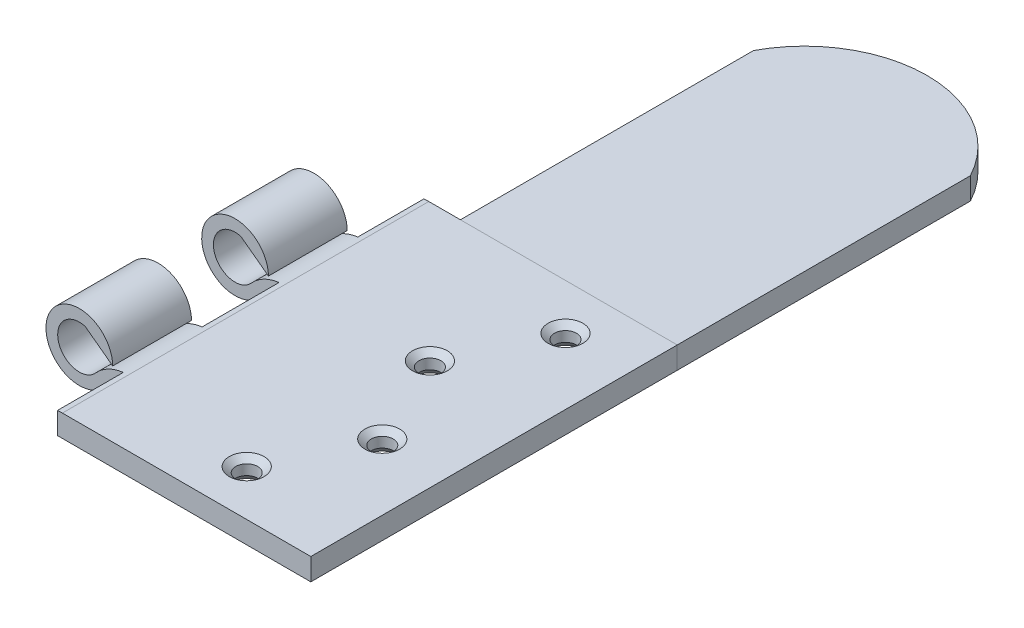
ISO-10303-21;
HEADER;
FILE_DESCRIPTION(('STEP AP214'),'2;1');
FILE_NAME('part.step','',(''),(''),'','','');
FILE_SCHEMA(('AUTOMOTIVE_DESIGN { 1 0 10303 214 1 1 1 1 }'));
ENDSEC;
DATA;
#1=APPLICATION_CONTEXT('core data for automotive mechanical design processes');
#2=APPLICATION_PROTOCOL_DEFINITION('international standard','automotive_design',2000,#1);
#3=PRODUCT_CONTEXT('',#1,'mechanical');
#4=PRODUCT('Part','Part','',(#3));
#5=PRODUCT_RELATED_PRODUCT_CATEGORY('part','',(#4));
#6=PRODUCT_DEFINITION_FORMATION('','',#4);
#7=PRODUCT_DEFINITION_CONTEXT('part definition',#1,'design');
#8=PRODUCT_DEFINITION('design','',#6,#7);
#9=PRODUCT_DEFINITION_SHAPE('','',#8);
#10=(LENGTH_UNIT() NAMED_UNIT(*) SI_UNIT(.MILLI.,.METRE.));
#11=(NAMED_UNIT(*) PLANE_ANGLE_UNIT() SI_UNIT($,.RADIAN.));
#12=(NAMED_UNIT(*) SI_UNIT($,.STERADIAN.) SOLID_ANGLE_UNIT());
#13=UNCERTAINTY_MEASURE_WITH_UNIT(LENGTH_MEASURE(1.E-05),#10,'distance_accuracy_value','');
#14=(GEOMETRIC_REPRESENTATION_CONTEXT(3) GLOBAL_UNCERTAINTY_ASSIGNED_CONTEXT((#13)) GLOBAL_UNIT_ASSIGNED_CONTEXT((#10,
#11,#12)) REPRESENTATION_CONTEXT('',''));
#15=CARTESIAN_POINT('',(0.,0.,0.));
#16=DIRECTION('',(0.,0.,1.));
#17=DIRECTION('',(1.,0.,0.));
#18=AXIS2_PLACEMENT_3D('',#15,#16,#17);
#19=CARTESIAN_POINT('',(40.5871280636835,0.044999999999999,-25.));
#20=DIRECTION('',(1.,0.,0.));
#21=DIRECTION('',(0.,0.,-1.));
#22=AXIS2_PLACEMENT_3D('',#19,#20,#21);
#23=PLANE('',#22);
#24=DIRECTION('',(0.,0.,1.));
#25=VECTOR('',#24,1.);
#26=CARTESIAN_POINT('',(40.5871280636835,-2.955,-25.));
#27=LINE('',#26,#25);
#28=CARTESIAN_POINT('',(40.5871280636835,-2.955,-65.));
#29=VERTEX_POINT('',#28);
#30=CARTESIAN_POINT('',(40.5871280636835,-2.955,-25.));
#31=VERTEX_POINT('',#30);
#32=EDGE_CURVE('E112',#29,#31,#27,.T.);
#33=ORIENTED_EDGE('',*,*,#32,.F.);
#34=DIRECTION('',(0.,-1.,0.));
#35=VECTOR('',#34,1.);
#36=CARTESIAN_POINT('',(40.5871280636835,0.044999999999999,-65.));
#37=LINE('',#36,#35);
#38=CARTESIAN_POINT('',(40.5871280636835,0.044999999999999,-65.));
#39=VERTEX_POINT('',#38);
#40=EDGE_CURVE('E12',#39,#29,#37,.T.);
#41=ORIENTED_EDGE('',*,*,#40,.F.);
#42=DIRECTION('',(0.,0.,1.));
#43=VECTOR('',#42,1.);
#44=CARTESIAN_POINT('',(40.5871280636835,0.044999999999999,-25.));
#45=LINE('',#44,#43);
#46=CARTESIAN_POINT('',(40.5871280636835,0.044999999999999,-25.));
#47=VERTEX_POINT('',#46);
#48=EDGE_CURVE('E106',#39,#47,#45,.T.);
#49=ORIENTED_EDGE('',*,*,#48,.T.);
#50=DIRECTION('',(0.,-1.,0.));
#51=VECTOR('',#50,1.);
#52=CARTESIAN_POINT('',(40.5871280636835,0.044999999999999,-25.));
#53=LINE('',#52,#51);
#54=EDGE_CURVE('E51',#47,#31,#53,.T.);
#55=ORIENTED_EDGE('',*,*,#54,.T.);
#56=EDGE_LOOP('',(#33,#41,#49,#55));
#57=FACE_BOUND('',#56,.T.);
#58=ADVANCED_FACE('F48',(#57),#23,.T.);
#59=CARTESIAN_POINT('',(25.7935640318418,0.044999999999999,-57.144240123591));
#60=DIRECTION('',(0.,-1.,0.));
#61=DIRECTION('',(0.,0.,-1.));
#62=AXIS2_PLACEMENT_3D('',#59,#60,#61);
#63=CYLINDRICAL_SURFACE('',#62,16.75);
#64=CARTESIAN_POINT('',(25.7935640318418,-2.955,-57.144240123591));
#65=DIRECTION('',(0.,-1.,0.));
#66=DIRECTION('',(0.,0.,-1.));
#67=AXIS2_PLACEMENT_3D('',#64,#65,#66);
#68=CIRCLE('',#67,16.75);
#69=CARTESIAN_POINT('',(11.,-2.955,-65.));
#70=VERTEX_POINT('',#69);
#71=EDGE_CURVE('E108',#70,#29,#68,.T.);
#72=ORIENTED_EDGE('',*,*,#71,.F.);
#73=DIRECTION('',(0.,-1.,0.));
#74=VECTOR('',#73,1.);
#75=CARTESIAN_POINT('',(11.,0.044999999999999,-65.));
#76=LINE('',#75,#74);
#77=CARTESIAN_POINT('',(11.,0.044999999999999,-65.));
#78=VERTEX_POINT('',#77);
#79=EDGE_CURVE('E57',#78,#70,#76,.T.);
#80=ORIENTED_EDGE('',*,*,#79,.F.);
#81=CARTESIAN_POINT('',(25.7935640318418,0.044999999999999,-57.144240123591));
#82=DIRECTION('',(0.,-1.,0.));
#83=DIRECTION('',(0.,0.,-1.));
#84=AXIS2_PLACEMENT_3D('',#81,#82,#83);
#85=CIRCLE('',#84,16.75);
#86=EDGE_CURVE('E103',#78,#39,#85,.T.);
#87=ORIENTED_EDGE('',*,*,#86,.T.);
#88=ORIENTED_EDGE('',*,*,#40,.T.);
#89=EDGE_LOOP('',(#72,#80,#87,#88));
#90=FACE_BOUND('',#89,.T.);
#91=ADVANCED_FACE('F122',(#90),#63,.T.);
#92=CARTESIAN_POINT('',(11.,0.044999999999999,-25.));
#93=DIRECTION('',(-1.,0.,0.));
#94=DIRECTION('',(0.,0.,1.));
#95=AXIS2_PLACEMENT_3D('',#92,#93,#94);
#96=PLANE('',#95);
#97=DIRECTION('',(0.,0.,-1.));
#98=VECTOR('',#97,1.);
#99=CARTESIAN_POINT('',(11.,-2.955,-25.));
#100=LINE('',#99,#98);
#101=CARTESIAN_POINT('',(11.,-2.955,-25.));
#102=VERTEX_POINT('',#101);
#103=EDGE_CURVE('E98',#102,#70,#100,.T.);
#104=ORIENTED_EDGE('',*,*,#103,.F.);
#105=DIRECTION('',(0.,-1.,0.));
#106=VECTOR('',#105,1.);
#107=CARTESIAN_POINT('',(11.,0.044999999999999,-25.));
#108=LINE('',#107,#106);
#109=CARTESIAN_POINT('',(11.,0.044999999999999,-25.));
#110=VERTEX_POINT('',#109);
#111=EDGE_CURVE('E93',#110,#102,#108,.T.);
#112=ORIENTED_EDGE('',*,*,#111,.F.);
#113=DIRECTION('',(0.,0.,-1.));
#114=VECTOR('',#113,1.);
#115=CARTESIAN_POINT('',(11.,0.044999999999999,-25.));
#116=LINE('',#115,#114);
#117=EDGE_CURVE('E96',#110,#78,#116,.T.);
#118=ORIENTED_EDGE('',*,*,#117,.T.);
#119=ORIENTED_EDGE('',*,*,#79,.T.);
#120=EDGE_LOOP('',(#104,#112,#118,#119));
#121=FACE_BOUND('',#120,.T.);
#122=ADVANCED_FACE('F95',(#121),#96,.T.);
#123=CARTESIAN_POINT('',(40.5871280636835,0.044999999999999,-25.));
#124=DIRECTION('',(0.,0.,1.));
#125=DIRECTION('',(1.,0.,0.));
#126=AXIS2_PLACEMENT_3D('',#123,#124,#125);
#127=PLANE('',#126);
#128=DIRECTION('',(-1.,0.,0.));
#129=VECTOR('',#128,1.);
#130=CARTESIAN_POINT('',(40.5871280636835,-2.955,-25.));
#131=LINE('',#130,#129);
#132=EDGE_CURVE('E115',#31,#102,#131,.T.);
#133=ORIENTED_EDGE('',*,*,#132,.F.);
#134=ORIENTED_EDGE('',*,*,#54,.F.);
#135=DIRECTION('',(-1.,0.,0.));
#136=VECTOR('',#135,1.);
#137=CARTESIAN_POINT('',(40.5871280636835,0.044999999999999,-25.));
#138=LINE('',#137,#136);
#139=EDGE_CURVE('E102',#47,#110,#138,.T.);
#140=ORIENTED_EDGE('',*,*,#139,.T.);
#141=ORIENTED_EDGE('',*,*,#111,.T.);
#142=EDGE_LOOP('',(#133,#134,#140,#141));
#143=FACE_BOUND('',#142,.T.);
#144=ADVANCED_FACE('F105',(#143),#127,.T.);
#145=CARTESIAN_POINT('',(25.7935640318418,0.044999999999999,-57.144240123591));
#146=DIRECTION('',(0.,-1.,0.));
#147=DIRECTION('',(0.,0.,-1.));
#148=AXIS2_PLACEMENT_3D('',#145,#146,#147);
#149=PLANE('',#148);
#150=ORIENTED_EDGE('',*,*,#48,.F.);
#151=ORIENTED_EDGE('',*,*,#86,.F.);
#152=ORIENTED_EDGE('',*,*,#117,.F.);
#153=ORIENTED_EDGE('',*,*,#139,.F.);
#154=EDGE_LOOP('',(#150,#151,#152,#153));
#155=FACE_BOUND('',#154,.T.);
#156=ADVANCED_FACE('F101',(#155),#149,.F.);
#157=CARTESIAN_POINT('',(25.7935640318418,-2.955,-57.144240123591));
#158=DIRECTION('',(0.,-1.,0.));
#159=DIRECTION('',(0.,0.,-1.));
#160=AXIS2_PLACEMENT_3D('',#157,#158,#159);
#161=PLANE('',#160);
#162=ORIENTED_EDGE('',*,*,#32,.T.);
#163=ORIENTED_EDGE('',*,*,#132,.T.);
#164=ORIENTED_EDGE('',*,*,#103,.T.);
#165=ORIENTED_EDGE('',*,*,#71,.T.);
#166=EDGE_LOOP('',(#162,#163,#164,#165));
#167=FACE_BOUND('',#166,.T.);
#168=ADVANCED_FACE('F121',(#167),#161,.T.);
#169=CLOSED_SHELL('',(#58,#91,#122,#144,#156,#168));
#170=MANIFOLD_SOLID_BREP('B2',#169);
#171=CARTESIAN_POINT('',(6.68804904288239,-5.955,25.));
#172=DIRECTION('',(0.,0.,-1.));
#173=DIRECTION('',(-1.,0.,0.));
#174=AXIS2_PLACEMENT_3D('',#171,#172,#173);
#175=CYLINDRICAL_SURFACE('',#174,6.);
#176=DIRECTION('',(0.,0.,-1.));
#177=VECTOR('',#176,1.);
#178=CARTESIAN_POINT('',(6.,0.00541848485394701,25.));
#179=LINE('',#178,#177);
#180=CARTESIAN_POINT('',(6.,0.00541848485394701,25.));
#181=VERTEX_POINT('',#180);
#182=CARTESIAN_POINT('',(6.,0.00541848485394701,16.));
#183=VERTEX_POINT('',#182);
#184=EDGE_CURVE('E331',#181,#183,#179,.T.);
#185=ORIENTED_EDGE('',*,*,#184,.F.);
#186=CARTESIAN_POINT('',(6.68804904288239,-5.955,25.));
#187=DIRECTION('',(0.,0.,1.));
#188=DIRECTION('',(1.,0.,0.));
#189=AXIS2_PLACEMENT_3D('',#186,#187,#188);
#190=CIRCLE('',#189,6.);
#191=CARTESIAN_POINT('',(6.68804904288239,0.044999999999999,25.));
#192=VERTEX_POINT('',#191);
#193=EDGE_CURVE('E375',#192,#181,#190,.T.);
#194=ORIENTED_EDGE('',*,*,#193,.F.);
#195=DIRECTION('',(0.,0.,-1.));
#196=VECTOR('',#195,1.);
#197=CARTESIAN_POINT('',(6.68804904288239,0.044999999999999,25.));
#198=LINE('',#197,#196);
#199=CARTESIAN_POINT('',(6.68804904288239,0.044999999999999,-25.));
#200=VERTEX_POINT('',#199);
#201=EDGE_CURVE('E385',#192,#200,#198,.T.);
#202=ORIENTED_EDGE('',*,*,#201,.T.);
#203=CARTESIAN_POINT('',(6.68804904288239,-5.955,-25.));
#204=DIRECTION('',(0.,0.,1.));
#205=DIRECTION('',(1.,0.,0.));
#206=AXIS2_PLACEMENT_3D('',#203,#204,#205);
#207=CIRCLE('',#206,6.);
#208=CARTESIAN_POINT('',(6.00000000000001,0.00541848485394701,-25.));
#209=VERTEX_POINT('',#208);
#210=EDGE_CURVE('E329',#200,#209,#207,.T.);
#211=ORIENTED_EDGE('',*,*,#210,.T.);
#212=DIRECTION('',(0.,0.,-1.));
#213=VECTOR('',#212,1.);
#214=CARTESIAN_POINT('',(6.00000000000001,0.00541848485394788,25.));
#215=LINE('',#214,#213);
#216=CARTESIAN_POINT('',(6.00000000000001,0.00541848485394788,-16.));
#217=VERTEX_POINT('',#216);
#218=EDGE_CURVE('E318',#217,#209,#215,.T.);
#219=ORIENTED_EDGE('',*,*,#218,.F.);
#220=CARTESIAN_POINT('',(6.68804904288239,-5.955,-16.));
#221=DIRECTION('',(0.,0.,-1.));
#222=DIRECTION('',(-1.,0.,0.));
#223=AXIS2_PLACEMENT_3D('',#220,#221,#222);
#224=CIRCLE('',#223,6.);
#225=CARTESIAN_POINT('',(2.20694415652903,-1.96505025125629,-16.));
#226=VERTEX_POINT('',#225);
#227=EDGE_CURVE('E303',#226,#217,#224,.T.);
#228=ORIENTED_EDGE('',*,*,#227,.F.);
#229=DIRECTION('',(0.,0.,-1.));
#230=VECTOR('',#229,1.);
#231=CARTESIAN_POINT('',(2.20694415652903,-1.96505025125629,25.));
#232=LINE('',#231,#230);
#233=CARTESIAN_POINT('',(2.20694415652903,-1.96505025125629,-5.25));
#234=VERTEX_POINT('',#233);
#235=EDGE_CURVE('E415',#234,#226,#232,.T.);
#236=ORIENTED_EDGE('',*,*,#235,.F.);
#237=CARTESIAN_POINT('',(6.68804904288239,-5.955,-5.25));
#238=DIRECTION('',(0.,0.,1.));
#239=DIRECTION('',(1.,0.,0.));
#240=AXIS2_PLACEMENT_3D('',#237,#238,#239);
#241=CIRCLE('',#240,6.);
#242=CARTESIAN_POINT('',(6.,0.00541848485394701,-5.25));
#243=VERTEX_POINT('',#242);
#244=EDGE_CURVE('E345',#243,#234,#241,.T.);
#245=ORIENTED_EDGE('',*,*,#244,.F.);
#246=DIRECTION('',(0.,0.,-1.));
#247=VECTOR('',#246,1.);
#248=CARTESIAN_POINT('',(6.,0.00541848485394701,25.));
#249=LINE('',#248,#247);
#250=CARTESIAN_POINT('',(6.,0.00541848485394701,5.25));
#251=VERTEX_POINT('',#250);
#252=EDGE_CURVE('E347',#251,#243,#249,.T.);
#253=ORIENTED_EDGE('',*,*,#252,.F.);
#254=CARTESIAN_POINT('',(6.68804904288239,-5.955,5.25));
#255=DIRECTION('',(0.,0.,-1.));
#256=DIRECTION('',(-1.,0.,0.));
#257=AXIS2_PLACEMENT_3D('',#254,#255,#256);
#258=CIRCLE('',#257,6.);
#259=CARTESIAN_POINT('',(2.20694415652903,-1.96505025125629,5.25));
#260=VERTEX_POINT('',#259);
#261=EDGE_CURVE('E357',#260,#251,#258,.T.);
#262=ORIENTED_EDGE('',*,*,#261,.F.);
#263=CARTESIAN_POINT('',(2.20694415652903,-1.96505025125629,16.));
#264=VERTEX_POINT('',#263);
#265=EDGE_CURVE('E417',#264,#260,#232,.T.);
#266=ORIENTED_EDGE('',*,*,#265,.F.);
#267=CARTESIAN_POINT('',(6.68804904288239,-5.955,16.));
#268=DIRECTION('',(0.,0.,1.));
#269=DIRECTION('',(1.,0.,0.));
#270=AXIS2_PLACEMENT_3D('',#267,#268,#269);
#271=CIRCLE('',#270,6.);
#272=EDGE_CURVE('E373',#183,#264,#271,.T.);
#273=ORIENTED_EDGE('',*,*,#272,.F.);
#274=EDGE_LOOP('',(#185,#194,#202,#211,#219,#228,#236,#245,#253,#262,#266,#273));
#275=FACE_BOUND('',#274,.T.);
#276=ADVANCED_FACE('F171',(#275),#175,.T.);
#277=CARTESIAN_POINT('',(0.,0.,25.));
#278=DIRECTION('',(0.,0.,-1.));
#279=DIRECTION('',(-1.,0.,0.));
#280=AXIS2_PLACEMENT_3D('',#277,#278,#279);
#281=CYLINDRICAL_SURFACE('',#280,2.95500000000001);
#282=CARTESIAN_POINT('',(0.,0.,16.));
#283=DIRECTION('',(0.,0.,1.));
#284=DIRECTION('',(1.,0.,0.));
#285=AXIS2_PLACEMENT_3D('',#282,#283,#284);
#286=CIRCLE('',#285,2.95500000000001);
#287=CARTESIAN_POINT('',(0.789396386604457,2.84760923316664,16.));
#288=VERTEX_POINT('',#287);
#289=EDGE_CURVE('E371',#264,#288,#286,.F.);
#290=ORIENTED_EDGE('',*,*,#289,.F.);
#291=ORIENTED_EDGE('',*,*,#265,.T.);
#292=CARTESIAN_POINT('',(0.,0.,5.25));
#293=DIRECTION('',(0.,0.,-1.));
#294=DIRECTION('',(-1.,0.,0.));
#295=AXIS2_PLACEMENT_3D('',#292,#293,#294);
#296=CIRCLE('',#295,2.95500000000001);
#297=CARTESIAN_POINT('',(0.789396386604457,2.84760923316664,5.25000000000001));
#298=VERTEX_POINT('',#297);
#299=EDGE_CURVE('E355',#298,#260,#296,.F.);
#300=ORIENTED_EDGE('',*,*,#299,.F.);
#301=DIRECTION('',(0.,0.,-1.));
#302=VECTOR('',#301,1.);
#303=CARTESIAN_POINT('',(0.789396386604457,2.84760923316664,25.));
#304=LINE('',#303,#302);
#305=EDGE_CURVE('E414',#288,#298,#304,.T.);
#306=ORIENTED_EDGE('',*,*,#305,.F.);
#307=EDGE_LOOP('',(#290,#291,#300,#306));
#308=FACE_BOUND('',#307,.T.);
#309=ADVANCED_FACE('F504',(#308),#281,.F.);
#310=CARTESIAN_POINT('',(0.,0.,-16.));
#311=DIRECTION('',(0.,0.,-1.));
#312=DIRECTION('',(-1.,0.,0.));
#313=AXIS2_PLACEMENT_3D('',#310,#311,#312);
#314=CIRCLE('',#313,2.95500000000001);
#315=CARTESIAN_POINT('',(0.789396386604457,2.84760923316664,-16.));
#316=VERTEX_POINT('',#315);
#317=EDGE_CURVE('E309',#316,#226,#314,.F.);
#318=ORIENTED_EDGE('',*,*,#317,.F.);
#319=CARTESIAN_POINT('',(0.789396386604457,2.84760923316664,-5.25));
#320=VERTEX_POINT('',#319);
#321=EDGE_CURVE('E411',#320,#316,#304,.T.);
#322=ORIENTED_EDGE('',*,*,#321,.F.);
#323=CARTESIAN_POINT('',(0.,0.,-5.25));
#324=DIRECTION('',(0.,0.,1.));
#325=DIRECTION('',(1.,0.,0.));
#326=AXIS2_PLACEMENT_3D('',#323,#324,#325);
#327=CIRCLE('',#326,2.95500000000001);
#328=EDGE_CURVE('E343',#234,#320,#327,.F.);
#329=ORIENTED_EDGE('',*,*,#328,.F.);
#330=ORIENTED_EDGE('',*,*,#235,.T.);
#331=EDGE_LOOP('',(#318,#322,#329,#330));
#332=FACE_BOUND('',#331,.T.);
#333=ADVANCED_FACE('F509',(#332),#281,.F.);
#334=CARTESIAN_POINT('',(4.55477771137078,0.044999999999999,25.));
#335=DIRECTION('',(0.597074522144533,0.802185773375393,0.));
#336=DIRECTION('',(-0.802185773375393,0.597074522144533,0.));
#337=AXIS2_PLACEMENT_3D('',#334,#335,#336);
#338=PLANE('',#337);
#339=DIRECTION('',(0.802185773375393,-0.597074522144533,0.));
#340=VECTOR('',#339,1.);
#341=CARTESIAN_POINT('',(4.55477771137078,0.044999999999999,16.));
#342=LINE('',#341,#340);
#343=CARTESIAN_POINT('',(4.55477771137078,0.044999999999999,16.));
#344=VERTEX_POINT('',#343);
#345=EDGE_CURVE('E369',#288,#344,#342,.T.);
#346=ORIENTED_EDGE('',*,*,#345,.F.);
#347=ORIENTED_EDGE('',*,*,#305,.T.);
#348=DIRECTION('',(-0.802185773375393,0.597074522144533,0.));
#349=VECTOR('',#348,1.);
#350=CARTESIAN_POINT('',(4.55477771137077,0.0450000000000011,5.25));
#351=LINE('',#350,#349);
#352=CARTESIAN_POINT('',(4.55477771137078,0.044999999999999,5.25));
#353=VERTEX_POINT('',#352);
#354=EDGE_CURVE('E353',#353,#298,#351,.T.);
#355=ORIENTED_EDGE('',*,*,#354,.F.);
#356=DIRECTION('',(0.,0.,-1.));
#357=VECTOR('',#356,1.);
#358=CARTESIAN_POINT('',(4.55477771137078,0.044999999999999,25.));
#359=LINE('',#358,#357);
#360=EDGE_CURVE('E410',#344,#353,#359,.T.);
#361=ORIENTED_EDGE('',*,*,#360,.F.);
#362=EDGE_LOOP('',(#346,#347,#355,#361));
#363=FACE_BOUND('',#362,.T.);
#364=ADVANCED_FACE('F609',(#363),#338,.F.);
#365=DIRECTION('',(-0.802185773375393,0.597074522144533,0.));
#366=VECTOR('',#365,1.);
#367=CARTESIAN_POINT('',(4.55477771137078,0.044999999999999,-16.));
#368=LINE('',#367,#366);
#369=CARTESIAN_POINT('',(4.55477771137078,0.044999999999999,-16.));
#370=VERTEX_POINT('',#369);
#371=EDGE_CURVE('E363',#370,#316,#368,.T.);
#372=ORIENTED_EDGE('',*,*,#371,.F.);
#373=CARTESIAN_POINT('',(4.55477771137078,0.044999999999999,-5.25));
#374=VERTEX_POINT('',#373);
#375=EDGE_CURVE('E407',#374,#370,#359,.T.);
#376=ORIENTED_EDGE('',*,*,#375,.F.);
#377=DIRECTION('',(0.802185773375393,-0.597074522144533,0.));
#378=VECTOR('',#377,1.);
#379=CARTESIAN_POINT('',(4.55477771137077,0.0450000000000032,-5.25));
#380=LINE('',#379,#378);
#381=EDGE_CURVE('E341',#320,#374,#380,.T.);
#382=ORIENTED_EDGE('',*,*,#381,.F.);
#383=ORIENTED_EDGE('',*,*,#321,.T.);
#384=EDGE_LOOP('',(#372,#376,#382,#383));
#385=FACE_BOUND('',#384,.T.);
#386=ADVANCED_FACE('F573',(#385),#338,.F.);
#387=CARTESIAN_POINT('',(0.,0.,25.));
#388=DIRECTION('',(0.,0.,-1.));
#389=DIRECTION('',(-1.,0.,0.));
#390=AXIS2_PLACEMENT_3D('',#387,#388,#389);
#391=CYLINDRICAL_SURFACE('',#390,4.555);
#392=CARTESIAN_POINT('',(0.,0.,16.));
#393=DIRECTION('',(0.,0.,1.));
#394=DIRECTION('',(1.,0.,0.));
#395=AXIS2_PLACEMENT_3D('',#392,#393,#394);
#396=CIRCLE('',#395,4.555);
#397=CARTESIAN_POINT('',(2.41111969020166,-3.86452155376599,16.));
#398=VERTEX_POINT('',#397);
#399=EDGE_CURVE('E367',#344,#398,#396,.T.);
#400=ORIENTED_EDGE('',*,*,#399,.F.);
#401=ORIENTED_EDGE('',*,*,#360,.T.);
#402=CARTESIAN_POINT('',(0.,0.,5.25));
#403=DIRECTION('',(0.,0.,-1.));
#404=DIRECTION('',(-1.,0.,0.));
#405=AXIS2_PLACEMENT_3D('',#402,#403,#404);
#406=CIRCLE('',#405,4.555);
#407=CARTESIAN_POINT('',(2.41111969020166,-3.86452155376599,5.25000000000001));
#408=VERTEX_POINT('',#407);
#409=EDGE_CURVE('E351',#408,#353,#406,.T.);
#410=ORIENTED_EDGE('',*,*,#409,.F.);
#411=DIRECTION('',(0.,0.,-1.));
#412=VECTOR('',#411,1.);
#413=CARTESIAN_POINT('',(2.41111969020166,-3.86452155376599,25.));
#414=LINE('',#413,#412);
#415=EDGE_CURVE('E406',#398,#408,#414,.T.);
#416=ORIENTED_EDGE('',*,*,#415,.F.);
#417=EDGE_LOOP('',(#400,#401,#410,#416));
#418=FACE_BOUND('',#417,.T.);
#419=ADVANCED_FACE('F616',(#418),#391,.T.);
#420=CARTESIAN_POINT('',(0.,0.,-16.));
#421=DIRECTION('',(0.,0.,-1.));
#422=DIRECTION('',(-1.,0.,0.));
#423=AXIS2_PLACEMENT_3D('',#420,#421,#422);
#424=CIRCLE('',#423,4.555);
#425=CARTESIAN_POINT('',(2.41111969020166,-3.86452155376599,-16.));
#426=VERTEX_POINT('',#425);
#427=EDGE_CURVE('E361',#426,#370,#424,.T.);
#428=ORIENTED_EDGE('',*,*,#427,.F.);
#429=CARTESIAN_POINT('',(2.41111969020166,-3.86452155376599,-5.25));
#430=VERTEX_POINT('',#429);
#431=EDGE_CURVE('E403',#430,#426,#414,.T.);
#432=ORIENTED_EDGE('',*,*,#431,.F.);
#433=CARTESIAN_POINT('',(0.,0.,-5.25));
#434=DIRECTION('',(0.,0.,1.));
#435=DIRECTION('',(1.,0.,0.));
#436=AXIS2_PLACEMENT_3D('',#433,#434,#435);
#437=CIRCLE('',#436,4.555);
#438=EDGE_CURVE('E339',#374,#430,#437,.T.);
#439=ORIENTED_EDGE('',*,*,#438,.F.);
#440=ORIENTED_EDGE('',*,*,#375,.T.);
#441=EDGE_LOOP('',(#428,#432,#439,#440));
#442=FACE_BOUND('',#441,.T.);
#443=ADVANCED_FACE('F569',(#442),#391,.T.);
#444=CARTESIAN_POINT('',(5.58712806368353,-8.955,25.));
#445=DIRECTION('',(0.,0.,-1.));
#446=DIRECTION('',(-1.,0.,0.));
#447=AXIS2_PLACEMENT_3D('',#444,#445,#446);
#448=CYLINDRICAL_SURFACE('',#447,6.);
#449=CARTESIAN_POINT('',(5.58712806368353,-8.955,16.));
#450=DIRECTION('',(0.,0.,1.));
#451=DIRECTION('',(1.,0.,0.));
#452=AXIS2_PLACEMENT_3D('',#449,#450,#451);
#453=CIRCLE('',#452,6.);
#454=CARTESIAN_POINT('',(5.58712806368353,-2.955,16.));
#455=VERTEX_POINT('',#454);
#456=EDGE_CURVE('E314',#398,#455,#453,.F.);
#457=ORIENTED_EDGE('',*,*,#456,.F.);
#458=ORIENTED_EDGE('',*,*,#415,.T.);
#459=CARTESIAN_POINT('',(5.58712806368353,-8.955,5.25));
#460=DIRECTION('',(0.,0.,-1.));
#461=DIRECTION('',(-1.,0.,0.));
#462=AXIS2_PLACEMENT_3D('',#459,#460,#461);
#463=CIRCLE('',#462,6.);
#464=CARTESIAN_POINT('',(5.58712806368353,-2.955,5.25));
#465=VERTEX_POINT('',#464);
#466=EDGE_CURVE('E349',#465,#408,#463,.F.);
#467=ORIENTED_EDGE('',*,*,#466,.F.);
#468=DIRECTION('',(0.,0.,-1.));
#469=VECTOR('',#468,1.);
#470=CARTESIAN_POINT('',(5.58712806368353,-2.955,25.));
#471=LINE('',#470,#469);
#472=EDGE_CURVE('E402',#455,#465,#471,.T.);
#473=ORIENTED_EDGE('',*,*,#472,.F.);
#474=EDGE_LOOP('',(#457,#458,#467,#473));
#475=FACE_BOUND('',#474,.T.);
#476=ADVANCED_FACE('F621',(#475),#448,.F.);
#477=CARTESIAN_POINT('',(5.58712806368353,-8.955,-16.));
#478=DIRECTION('',(0.,0.,-1.));
#479=DIRECTION('',(-1.,0.,0.));
#480=AXIS2_PLACEMENT_3D('',#477,#478,#479);
#481=CIRCLE('',#480,6.);
#482=CARTESIAN_POINT('',(5.58712806368353,-2.955,-16.));
#483=VERTEX_POINT('',#482);
#484=EDGE_CURVE('E359',#483,#426,#481,.F.);
#485=ORIENTED_EDGE('',*,*,#484,.F.);
#486=CARTESIAN_POINT('',(5.58712806368353,-2.955,-5.25));
#487=VERTEX_POINT('',#486);
#488=EDGE_CURVE('E399',#487,#483,#471,.T.);
#489=ORIENTED_EDGE('',*,*,#488,.F.);
#490=CARTESIAN_POINT('',(5.58712806368353,-8.955,-5.25));
#491=DIRECTION('',(0.,0.,1.));
#492=DIRECTION('',(1.,0.,0.));
#493=AXIS2_PLACEMENT_3D('',#490,#491,#492);
#494=CIRCLE('',#493,6.);
#495=EDGE_CURVE('E186',#430,#487,#494,.F.);
#496=ORIENTED_EDGE('',*,*,#495,.F.);
#497=ORIENTED_EDGE('',*,*,#431,.T.);
#498=EDGE_LOOP('',(#485,#489,#496,#497));
#499=FACE_BOUND('',#498,.T.);
#500=ADVANCED_FACE('F565',(#499),#448,.F.);
#501=CARTESIAN_POINT('',(5.58712806368353,-2.955,25.));
#502=DIRECTION('',(0.,1.,0.));
#503=DIRECTION('',(0.,0.,1.));
#504=AXIS2_PLACEMENT_3D('',#501,#502,#503);
#505=PLANE('',#504);
#506=CARTESIAN_POINT('',(31.5871280636835,-2.955,-18.75));
#507=DIRECTION('',(0.,1.,0.));
#508=DIRECTION('',(0.,0.,1.));
#509=AXIS2_PLACEMENT_3D('',#506,#507,#508);
#510=CIRCLE('',#509,2.23421217728012);
#511=CARTESIAN_POINT('',(31.5871280636835,-2.955,-16.5157878227199));
#512=VERTEX_POINT('',#511);
#513=EDGE_CURVE('E441',#512,#512,#510,.T.);
#514=ORIENTED_EDGE('',*,*,#513,.T.);
#515=EDGE_LOOP('',(#514));
#516=FACE_BOUND('',#515,.T.);
#517=CARTESIAN_POINT('',(25.5871280636835,-2.955,-6.25));
#518=DIRECTION('',(0.,1.,0.));
#519=DIRECTION('',(0.,0.,1.));
#520=AXIS2_PLACEMENT_3D('',#517,#518,#519);
#521=CIRCLE('',#520,2.23421217728012);
#522=CARTESIAN_POINT('',(25.5871280636835,-2.955,-4.01578782271988));
#523=VERTEX_POINT('',#522);
#524=EDGE_CURVE('E438',#523,#523,#521,.T.);
#525=ORIENTED_EDGE('',*,*,#524,.T.);
#526=EDGE_LOOP('',(#525));
#527=FACE_BOUND('',#526,.T.);
#528=CARTESIAN_POINT('',(31.5871280636835,-2.955,6.25));
#529=DIRECTION('',(0.,1.,0.));
#530=DIRECTION('',(0.,0.,1.));
#531=AXIS2_PLACEMENT_3D('',#528,#529,#530);
#532=CIRCLE('',#531,2.23421217728012);
#533=CARTESIAN_POINT('',(31.5871280636835,-2.955,8.48421217728012));
#534=VERTEX_POINT('',#533);
#535=EDGE_CURVE('E435',#534,#534,#532,.T.);
#536=ORIENTED_EDGE('',*,*,#535,.T.);
#537=EDGE_LOOP('',(#536));
#538=FACE_BOUND('',#537,.T.);
#539=CARTESIAN_POINT('',(25.5871280636835,-2.955,18.75));
#540=DIRECTION('',(0.,1.,0.));
#541=DIRECTION('',(0.,0.,1.));
#542=AXIS2_PLACEMENT_3D('',#539,#540,#541);
#543=CIRCLE('',#542,2.23421217728012);
#544=CARTESIAN_POINT('',(25.5871280636835,-2.955,20.9842121772801));
#545=VERTEX_POINT('',#544);
#546=EDGE_CURVE('E432',#545,#545,#543,.T.);
#547=ORIENTED_EDGE('',*,*,#546,.T.);
#548=EDGE_LOOP('',(#547));
#549=FACE_BOUND('',#548,.T.);
#550=DIRECTION('',(0.,0.,1.));
#551=VECTOR('',#550,1.);
#552=CARTESIAN_POINT('',(6.,-2.955,25.));
#553=LINE('',#552,#551);
#554=CARTESIAN_POINT('',(6.,-2.955,16.));
#555=VERTEX_POINT('',#554);
#556=CARTESIAN_POINT('',(6.,-2.955,25.));
#557=VERTEX_POINT('',#556);
#558=EDGE_CURVE('E194',#555,#557,#553,.T.);
#559=ORIENTED_EDGE('',*,*,#558,.F.);
#560=DIRECTION('',(1.,0.,0.));
#561=VECTOR('',#560,1.);
#562=CARTESIAN_POINT('',(5.58712806368353,-2.955,16.));
#563=LINE('',#562,#561);
#564=EDGE_CURVE('E430',#455,#555,#563,.T.);
#565=ORIENTED_EDGE('',*,*,#564,.F.);
#566=ORIENTED_EDGE('',*,*,#472,.T.);
#567=DIRECTION('',(-1.,0.,0.));
#568=VECTOR('',#567,1.);
#569=CARTESIAN_POINT('',(5.58712806368352,-2.955,5.25));
#570=LINE('',#569,#568);
#571=CARTESIAN_POINT('',(6.,-2.955,5.25));
#572=VERTEX_POINT('',#571);
#573=EDGE_CURVE('E426',#572,#465,#570,.T.);
#574=ORIENTED_EDGE('',*,*,#573,.F.);
#575=DIRECTION('',(0.,0.,1.));
#576=VECTOR('',#575,1.);
#577=CARTESIAN_POINT('',(6.,-2.955,25.));
#578=LINE('',#577,#576);
#579=CARTESIAN_POINT('',(6.,-2.955,-5.25));
#580=VERTEX_POINT('',#579);
#581=EDGE_CURVE('E424',#580,#572,#578,.T.);
#582=ORIENTED_EDGE('',*,*,#581,.F.);
#583=DIRECTION('',(1.,0.,0.));
#584=VECTOR('',#583,1.);
#585=CARTESIAN_POINT('',(5.58712806368352,-2.955,-5.25));
#586=LINE('',#585,#584);
#587=EDGE_CURVE('E422',#487,#580,#586,.T.);
#588=ORIENTED_EDGE('',*,*,#587,.F.);
#589=ORIENTED_EDGE('',*,*,#488,.T.);
#590=DIRECTION('',(-1.,0.,0.));
#591=VECTOR('',#590,1.);
#592=CARTESIAN_POINT('',(5.58712806368353,-2.955,-16.));
#593=LINE('',#592,#591);
#594=CARTESIAN_POINT('',(6.00000000000001,-2.955,-16.));
#595=VERTEX_POINT('',#594);
#596=EDGE_CURVE('E428',#595,#483,#593,.T.);
#597=ORIENTED_EDGE('',*,*,#596,.F.);
#598=DIRECTION('',(0.,0.,1.));
#599=VECTOR('',#598,1.);
#600=CARTESIAN_POINT('',(6.00000000000001,-2.955,25.));
#601=LINE('',#600,#599);
#602=CARTESIAN_POINT('',(6.00000000000001,-2.955,-25.));
#603=VERTEX_POINT('',#602);
#604=EDGE_CURVE('E321',#603,#595,#601,.T.);
#605=ORIENTED_EDGE('',*,*,#604,.F.);
#606=DIRECTION('',(1.,0.,0.));
#607=VECTOR('',#606,1.);
#608=CARTESIAN_POINT('',(5.58712806368353,-2.955,-25.));
#609=LINE('',#608,#607);
#610=CARTESIAN_POINT('',(40.5871280636835,-2.955,-25.));
#611=VERTEX_POINT('',#610);
#612=EDGE_CURVE('E387',#603,#611,#609,.T.);
#613=ORIENTED_EDGE('',*,*,#612,.T.);
#614=DIRECTION('',(0.,0.,-1.));
#615=VECTOR('',#614,1.);
#616=CARTESIAN_POINT('',(40.5871280636835,-2.955,25.));
#617=LINE('',#616,#615);
#618=CARTESIAN_POINT('',(40.5871280636835,-2.955,25.));
#619=VERTEX_POINT('',#618);
#620=EDGE_CURVE('E396',#619,#611,#617,.T.);
#621=ORIENTED_EDGE('',*,*,#620,.F.);
#622=DIRECTION('',(1.,0.,0.));
#623=VECTOR('',#622,1.);
#624=CARTESIAN_POINT('',(5.58712806368353,-2.955,25.));
#625=LINE('',#624,#623);
#626=EDGE_CURVE('E378',#557,#619,#625,.T.);
#627=ORIENTED_EDGE('',*,*,#626,.F.);
#628=EDGE_LOOP('',(#559,#565,#566,#574,#582,#588,#589,#597,#605,#613,#621,#627));
#629=FACE_BOUND('',#628,.T.);
#630=ADVANCED_FACE('F559',(#516,#527,#538,#549,#629),#505,.F.);
#631=CARTESIAN_POINT('',(6.68804904288239,-5.955,25.));
#632=DIRECTION('',(0.,0.,1.));
#633=DIRECTION('',(1.,0.,0.));
#634=AXIS2_PLACEMENT_3D('',#631,#632,#633);
#635=PLANE('',#634);
#636=ORIENTED_EDGE('',*,*,#193,.T.);
#637=DIRECTION('',(0.,-1.,0.));
#638=VECTOR('',#637,1.);
#639=CARTESIAN_POINT('',(6.,-5.955,25.));
#640=LINE('',#639,#638);
#641=EDGE_CURVE('E420',#181,#557,#640,.T.);
#642=ORIENTED_EDGE('',*,*,#641,.T.);
#643=ORIENTED_EDGE('',*,*,#626,.T.);
#644=DIRECTION('',(0.,1.,0.));
#645=VECTOR('',#644,1.);
#646=CARTESIAN_POINT('',(40.5871280636835,0.044999999999999,25.));
#647=LINE('',#646,#645);
#648=CARTESIAN_POINT('',(40.5871280636835,0.044999999999999,25.));
#649=VERTEX_POINT('',#648);
#650=EDGE_CURVE('E381',#619,#649,#647,.T.);
#651=ORIENTED_EDGE('',*,*,#650,.T.);
#652=DIRECTION('',(-1.,0.,0.));
#653=VECTOR('',#652,1.);
#654=CARTESIAN_POINT('',(6.68804904288239,0.044999999999999,25.));
#655=LINE('',#654,#653);
#656=EDGE_CURVE('E383',#649,#192,#655,.T.);
#657=ORIENTED_EDGE('',*,*,#656,.T.);
#658=EDGE_LOOP('',(#636,#642,#643,#651,#657));
#659=FACE_BOUND('',#658,.T.);
#660=ADVANCED_FACE('F598',(#659),#635,.T.);
#661=CARTESIAN_POINT('',(6.68804904288239,-5.955,-25.));
#662=DIRECTION('',(0.,0.,1.));
#663=DIRECTION('',(1.,0.,0.));
#664=AXIS2_PLACEMENT_3D('',#661,#662,#663);
#665=PLANE('',#664);
#666=DIRECTION('',(0.,-1.,0.));
#667=VECTOR('',#666,1.);
#668=CARTESIAN_POINT('',(6.00000000000001,-5.955,-25.));
#669=LINE('',#668,#667);
#670=EDGE_CURVE('E418',#209,#603,#669,.T.);
#671=ORIENTED_EDGE('',*,*,#670,.F.);
#672=ORIENTED_EDGE('',*,*,#210,.F.);
#673=DIRECTION('',(-1.,0.,0.));
#674=VECTOR('',#673,1.);
#675=CARTESIAN_POINT('',(6.68804904288239,0.044999999999999,-25.));
#676=LINE('',#675,#674);
#677=CARTESIAN_POINT('',(40.5871280636835,0.044999999999999,-25.));
#678=VERTEX_POINT('',#677);
#679=EDGE_CURVE('E379',#678,#200,#676,.T.);
#680=ORIENTED_EDGE('',*,*,#679,.F.);
#681=DIRECTION('',(0.,1.,0.));
#682=VECTOR('',#681,1.);
#683=CARTESIAN_POINT('',(40.5871280636835,0.044999999999999,-25.));
#684=LINE('',#683,#682);
#685=EDGE_CURVE('E389',#611,#678,#684,.T.);
#686=ORIENTED_EDGE('',*,*,#685,.F.);
#687=ORIENTED_EDGE('',*,*,#612,.F.);
#688=EDGE_LOOP('',(#671,#672,#680,#686,#687));
#689=FACE_BOUND('',#688,.T.);
#690=ADVANCED_FACE('F556',(#689),#665,.F.);
#691=CARTESIAN_POINT('',(40.5871280636835,0.044999999999999,25.));
#692=DIRECTION('',(-1.,0.,0.));
#693=DIRECTION('',(0.,0.,1.));
#694=AXIS2_PLACEMENT_3D('',#691,#692,#693);
#695=PLANE('',#694);
#696=ORIENTED_EDGE('',*,*,#685,.T.);
#697=DIRECTION('',(0.,0.,-1.));
#698=VECTOR('',#697,1.);
#699=CARTESIAN_POINT('',(40.5871280636835,0.044999999999999,25.));
#700=LINE('',#699,#698);
#701=EDGE_CURVE('E393',#649,#678,#700,.T.);
#702=ORIENTED_EDGE('',*,*,#701,.F.);
#703=ORIENTED_EDGE('',*,*,#650,.F.);
#704=ORIENTED_EDGE('',*,*,#620,.T.);
#705=EDGE_LOOP('',(#696,#702,#703,#704));
#706=FACE_BOUND('',#705,.T.);
#707=ADVANCED_FACE('F544',(#706),#695,.F.);
#708=CARTESIAN_POINT('',(6.68804904288239,0.044999999999999,25.));
#709=DIRECTION('',(0.,-1.,0.));
#710=DIRECTION('',(0.,0.,-1.));
#711=AXIS2_PLACEMENT_3D('',#708,#709,#710);
#712=PLANE('',#711);
#713=CARTESIAN_POINT('',(25.5871280636835,0.044999999999999,18.75));
#714=DIRECTION('',(0.,-1.,0.));
#715=DIRECTION('',(0.,0.,-1.));
#716=AXIS2_PLACEMENT_3D('',#713,#714,#715);
#717=CIRCLE('',#716,2.375);
#718=CARTESIAN_POINT('',(25.5871280636835,0.044999999999999,16.375));
#719=VERTEX_POINT('',#718);
#720=EDGE_CURVE('E46',#719,#719,#717,.T.);
#721=ORIENTED_EDGE('',*,*,#720,.T.);
#722=EDGE_LOOP('',(#721));
#723=FACE_BOUND('',#722,.T.);
#724=CARTESIAN_POINT('',(31.5871280636835,0.044999999999999,6.25));
#725=DIRECTION('',(0.,-1.,0.));
#726=DIRECTION('',(0.,0.,-1.));
#727=AXIS2_PLACEMENT_3D('',#724,#725,#726);
#728=CIRCLE('',#727,2.375);
#729=CARTESIAN_POINT('',(31.5871280636835,0.044999999999999,3.875));
#730=VERTEX_POINT('',#729);
#731=EDGE_CURVE('E179',#730,#730,#728,.T.);
#732=ORIENTED_EDGE('',*,*,#731,.T.);
#733=EDGE_LOOP('',(#732));
#734=FACE_BOUND('',#733,.T.);
#735=CARTESIAN_POINT('',(25.5871280636835,0.044999999999999,-6.25));
#736=DIRECTION('',(0.,-1.,0.));
#737=DIRECTION('',(0.,0.,-1.));
#738=AXIS2_PLACEMENT_3D('',#735,#736,#737);
#739=CIRCLE('',#738,2.375);
#740=CARTESIAN_POINT('',(25.5871280636835,0.044999999999999,-8.625));
#741=VERTEX_POINT('',#740);
#742=EDGE_CURVE('E471',#741,#741,#739,.T.);
#743=ORIENTED_EDGE('',*,*,#742,.T.);
#744=EDGE_LOOP('',(#743));
#745=FACE_BOUND('',#744,.T.);
#746=CARTESIAN_POINT('',(31.5871280636835,0.044999999999999,-18.75));
#747=DIRECTION('',(0.,-1.,0.));
#748=DIRECTION('',(0.,0.,-1.));
#749=AXIS2_PLACEMENT_3D('',#746,#747,#748);
#750=CIRCLE('',#749,2.375);
#751=CARTESIAN_POINT('',(31.5871280636835,0.044999999999999,-21.125));
#752=VERTEX_POINT('',#751);
#753=EDGE_CURVE('E468',#752,#752,#750,.T.);
#754=ORIENTED_EDGE('',*,*,#753,.T.);
#755=EDGE_LOOP('',(#754));
#756=FACE_BOUND('',#755,.T.);
#757=ORIENTED_EDGE('',*,*,#679,.T.);
#758=ORIENTED_EDGE('',*,*,#201,.F.);
#759=ORIENTED_EDGE('',*,*,#656,.F.);
#760=ORIENTED_EDGE('',*,*,#701,.T.);
#761=EDGE_LOOP('',(#757,#758,#759,#760));
#762=FACE_BOUND('',#761,.T.);
#763=ADVANCED_FACE('F476',(#723,#734,#745,#756,#762),#712,.F.);
#764=CARTESIAN_POINT('',(6.00000000000001,6.,-16.));
#765=DIRECTION('',(0.,0.,-1.));
#766=DIRECTION('',(-1.,0.,0.));
#767=AXIS2_PLACEMENT_3D('',#764,#765,#766);
#768=PLANE('',#767);
#769=ORIENTED_EDGE('',*,*,#227,.T.);
#770=DIRECTION('',(0.,-1.,0.));
#771=VECTOR('',#770,1.);
#772=CARTESIAN_POINT('',(6.00000000000001,6.,-16.));
#773=LINE('',#772,#771);
#774=EDGE_CURVE('E306',#217,#595,#773,.T.);
#775=ORIENTED_EDGE('',*,*,#774,.T.);
#776=ORIENTED_EDGE('',*,*,#596,.T.);
#777=ORIENTED_EDGE('',*,*,#484,.T.);
#778=ORIENTED_EDGE('',*,*,#427,.T.);
#779=ORIENTED_EDGE('',*,*,#371,.T.);
#780=ORIENTED_EDGE('',*,*,#317,.T.);
#781=EDGE_LOOP('',(#769,#775,#776,#777,#778,#779,#780));
#782=FACE_BOUND('',#781,.T.);
#783=ADVANCED_FACE('F305',(#782),#768,.T.);
#784=CARTESIAN_POINT('',(6.00000000000001,6.,-25.5));
#785=DIRECTION('',(-1.,0.,0.));
#786=DIRECTION('',(0.,0.,1.));
#787=AXIS2_PLACEMENT_3D('',#784,#785,#786);
#788=PLANE('',#787);
#789=ORIENTED_EDGE('',*,*,#218,.T.);
#790=ORIENTED_EDGE('',*,*,#670,.T.);
#791=ORIENTED_EDGE('',*,*,#604,.T.);
#792=ORIENTED_EDGE('',*,*,#774,.F.);
#793=EDGE_LOOP('',(#789,#790,#791,#792));
#794=FACE_BOUND('',#793,.T.);
#795=ADVANCED_FACE('F317',(#794),#788,.T.);
#796=CARTESIAN_POINT('',(-6.,6.,16.));
#797=DIRECTION('',(0.,0.,1.));
#798=DIRECTION('',(1.,0.,0.));
#799=AXIS2_PLACEMENT_3D('',#796,#797,#798);
#800=PLANE('',#799);
#801=ORIENTED_EDGE('',*,*,#272,.T.);
#802=ORIENTED_EDGE('',*,*,#289,.T.);
#803=ORIENTED_EDGE('',*,*,#345,.T.);
#804=ORIENTED_EDGE('',*,*,#399,.T.);
#805=ORIENTED_EDGE('',*,*,#456,.T.);
#806=ORIENTED_EDGE('',*,*,#564,.T.);
#807=DIRECTION('',(0.,-1.,0.));
#808=VECTOR('',#807,1.);
#809=CARTESIAN_POINT('',(6.,6.,16.));
#810=LINE('',#809,#808);
#811=EDGE_CURVE('E323',#183,#555,#810,.T.);
#812=ORIENTED_EDGE('',*,*,#811,.F.);
#813=EDGE_LOOP('',(#801,#802,#803,#804,#805,#806,#812));
#814=FACE_BOUND('',#813,.T.);
#815=ADVANCED_FACE('F602',(#814),#800,.T.);
#816=CARTESIAN_POINT('',(6.,6.,25.5));
#817=DIRECTION('',(-1.,0.,0.));
#818=DIRECTION('',(0.,0.,1.));
#819=AXIS2_PLACEMENT_3D('',#816,#817,#818);
#820=PLANE('',#819);
#821=ORIENTED_EDGE('',*,*,#184,.T.);
#822=ORIENTED_EDGE('',*,*,#811,.T.);
#823=ORIENTED_EDGE('',*,*,#558,.T.);
#824=ORIENTED_EDGE('',*,*,#641,.F.);
#825=EDGE_LOOP('',(#821,#822,#823,#824));
#826=FACE_BOUND('',#825,.T.);
#827=ADVANCED_FACE('F589',(#826),#820,.T.);
#828=CARTESIAN_POINT('',(6.,6.,5.25));
#829=DIRECTION('',(0.,0.,-1.));
#830=DIRECTION('',(-1.,0.,0.));
#831=AXIS2_PLACEMENT_3D('',#828,#829,#830);
#832=PLANE('',#831);
#833=ORIENTED_EDGE('',*,*,#261,.T.);
#834=DIRECTION('',(0.,-1.,0.));
#835=VECTOR('',#834,1.);
#836=CARTESIAN_POINT('',(6.,6.,5.25));
#837=LINE('',#836,#835);
#838=EDGE_CURVE('E333',#251,#572,#837,.T.);
#839=ORIENTED_EDGE('',*,*,#838,.T.);
#840=ORIENTED_EDGE('',*,*,#573,.T.);
#841=ORIENTED_EDGE('',*,*,#466,.T.);
#842=ORIENTED_EDGE('',*,*,#409,.T.);
#843=ORIENTED_EDGE('',*,*,#354,.T.);
#844=ORIENTED_EDGE('',*,*,#299,.T.);
#845=EDGE_LOOP('',(#833,#839,#840,#841,#842,#843,#844));
#846=FACE_BOUND('',#845,.T.);
#847=ADVANCED_FACE('F624',(#846),#832,.T.);
#848=CARTESIAN_POINT('',(6.,6.,-5.25));
#849=DIRECTION('',(-1.,0.,0.));
#850=DIRECTION('',(0.,0.,1.));
#851=AXIS2_PLACEMENT_3D('',#848,#849,#850);
#852=PLANE('',#851);
#853=ORIENTED_EDGE('',*,*,#252,.T.);
#854=DIRECTION('',(0.,-1.,0.));
#855=VECTOR('',#854,1.);
#856=CARTESIAN_POINT('',(6.,6.,-5.25));
#857=LINE('',#856,#855);
#858=EDGE_CURVE('E322',#243,#580,#857,.T.);
#859=ORIENTED_EDGE('',*,*,#858,.T.);
#860=ORIENTED_EDGE('',*,*,#581,.T.);
#861=ORIENTED_EDGE('',*,*,#838,.F.);
#862=EDGE_LOOP('',(#853,#859,#860,#861));
#863=FACE_BOUND('',#862,.T.);
#864=ADVANCED_FACE('F626',(#863),#852,.T.);
#865=CARTESIAN_POINT('',(6.,6.,-5.25));
#866=DIRECTION('',(0.,0.,1.));
#867=DIRECTION('',(1.,0.,0.));
#868=AXIS2_PLACEMENT_3D('',#865,#866,#867);
#869=PLANE('',#868);
#870=ORIENTED_EDGE('',*,*,#244,.T.);
#871=ORIENTED_EDGE('',*,*,#328,.T.);
#872=ORIENTED_EDGE('',*,*,#381,.T.);
#873=ORIENTED_EDGE('',*,*,#438,.T.);
#874=ORIENTED_EDGE('',*,*,#495,.T.);
#875=ORIENTED_EDGE('',*,*,#587,.T.);
#876=ORIENTED_EDGE('',*,*,#858,.F.);
#877=EDGE_LOOP('',(#870,#871,#872,#873,#874,#875,#876));
#878=FACE_BOUND('',#877,.T.);
#879=ADVANCED_FACE('F500',(#878),#869,.T.);
#880=CARTESIAN_POINT('',(25.5871280636835,-5.955,18.75));
#881=DIRECTION('',(0.,1.,0.));
#882=DIRECTION('',(0.,0.,1.));
#883=AXIS2_PLACEMENT_3D('',#880,#881,#882);
#884=CYLINDRICAL_SURFACE('',#883,1.5);
#885=CARTESIAN_POINT('',(25.5871280636835,-2.07999999999999,18.75));
#886=DIRECTION('',(0.,1.,0.));
#887=DIRECTION('',(0.,0.,1.));
#888=AXIS2_PLACEMENT_3D('',#885,#886,#887);
#889=CIRCLE('',#888,1.5);
#890=CARTESIAN_POINT('',(25.5871280636835,-2.07999999999999,20.25));
#891=VERTEX_POINT('',#890);
#892=EDGE_CURVE('E465',#891,#891,#889,.F.);
#893=ORIENTED_EDGE('',*,*,#892,.T.);
#894=EDGE_LOOP('',(#893));
#895=FACE_BOUND('',#894,.T.);
#896=CARTESIAN_POINT('',(25.5871280636835,-0.689212177280121,18.75));
#897=DIRECTION('',(0.,-1.,0.));
#898=DIRECTION('',(0.,0.,-1.));
#899=AXIS2_PLACEMENT_3D('',#896,#897,#898);
#900=CIRCLE('',#899,1.5);
#901=CARTESIAN_POINT('',(25.5871280636835,-0.689212177280121,17.25));
#902=VERTEX_POINT('',#901);
#903=EDGE_CURVE('E462',#902,#902,#900,.F.);
#904=ORIENTED_EDGE('',*,*,#903,.T.);
#905=EDGE_LOOP('',(#904));
#906=FACE_BOUND('',#905,.T.);
#907=ADVANCED_FACE('F490',(#895,#906),#884,.F.);
#908=CARTESIAN_POINT('',(31.5871280636835,-5.955,6.25));
#909=DIRECTION('',(0.,1.,0.));
#910=DIRECTION('',(0.,0.,1.));
#911=AXIS2_PLACEMENT_3D('',#908,#909,#910);
#912=CYLINDRICAL_SURFACE('',#911,1.5);
#913=CARTESIAN_POINT('',(31.5871280636835,-2.07999999999999,6.25));
#914=DIRECTION('',(0.,1.,0.));
#915=DIRECTION('',(0.,0.,1.));
#916=AXIS2_PLACEMENT_3D('',#913,#914,#915);
#917=CIRCLE('',#916,1.5);
#918=CARTESIAN_POINT('',(31.5871280636835,-2.07999999999999,7.75000000000001));
#919=VERTEX_POINT('',#918);
#920=EDGE_CURVE('E459',#919,#919,#917,.F.);
#921=ORIENTED_EDGE('',*,*,#920,.T.);
#922=EDGE_LOOP('',(#921));
#923=FACE_BOUND('',#922,.T.);
#924=CARTESIAN_POINT('',(31.5871280636835,-0.689212177280118,6.25));
#925=DIRECTION('',(0.,-1.,0.));
#926=DIRECTION('',(0.,0.,-1.));
#927=AXIS2_PLACEMENT_3D('',#924,#925,#926);
#928=CIRCLE('',#927,1.5);
#929=CARTESIAN_POINT('',(31.5871280636835,-0.689212177280118,4.75));
#930=VERTEX_POINT('',#929);
#931=EDGE_CURVE('E456',#930,#930,#928,.F.);
#932=ORIENTED_EDGE('',*,*,#931,.T.);
#933=EDGE_LOOP('',(#932));
#934=FACE_BOUND('',#933,.T.);
#935=ADVANCED_FACE('F487',(#923,#934),#912,.F.);
#936=CARTESIAN_POINT('',(25.5871280636835,-5.955,-6.25));
#937=DIRECTION('',(0.,1.,0.));
#938=DIRECTION('',(0.,0.,1.));
#939=AXIS2_PLACEMENT_3D('',#936,#937,#938);
#940=CYLINDRICAL_SURFACE('',#939,1.5);
#941=CARTESIAN_POINT('',(25.5871280636835,-2.07999999999999,-6.25));
#942=DIRECTION('',(0.,1.,0.));
#943=DIRECTION('',(0.,0.,1.));
#944=AXIS2_PLACEMENT_3D('',#941,#942,#943);
#945=CIRCLE('',#944,1.5);
#946=CARTESIAN_POINT('',(25.5871280636835,-2.07999999999999,-4.75));
#947=VERTEX_POINT('',#946);
#948=EDGE_CURVE('E453',#947,#947,#945,.F.);
#949=ORIENTED_EDGE('',*,*,#948,.T.);
#950=EDGE_LOOP('',(#949));
#951=FACE_BOUND('',#950,.T.);
#952=CARTESIAN_POINT('',(25.5871280636835,-0.689212177280121,-6.25));
#953=DIRECTION('',(0.,-1.,0.));
#954=DIRECTION('',(0.,0.,-1.));
#955=AXIS2_PLACEMENT_3D('',#952,#953,#954);
#956=CIRCLE('',#955,1.5);
#957=CARTESIAN_POINT('',(25.5871280636835,-0.689212177280121,-7.75));
#958=VERTEX_POINT('',#957);
#959=EDGE_CURVE('E450',#958,#958,#956,.F.);
#960=ORIENTED_EDGE('',*,*,#959,.T.);
#961=EDGE_LOOP('',(#960));
#962=FACE_BOUND('',#961,.T.);
#963=ADVANCED_FACE('F489',(#951,#962),#940,.F.);
#964=CARTESIAN_POINT('',(31.5871280636835,-5.955,-18.75));
#965=DIRECTION('',(0.,1.,0.));
#966=DIRECTION('',(0.,0.,1.));
#967=AXIS2_PLACEMENT_3D('',#964,#965,#966);
#968=CYLINDRICAL_SURFACE('',#967,1.5);
#969=CARTESIAN_POINT('',(31.5871280636835,-2.08,-18.75));
#970=DIRECTION('',(0.,1.,0.));
#971=DIRECTION('',(0.,0.,1.));
#972=AXIS2_PLACEMENT_3D('',#969,#970,#971);
#973=CIRCLE('',#972,1.5);
#974=CARTESIAN_POINT('',(31.5871280636835,-2.08,-17.25));
#975=VERTEX_POINT('',#974);
#976=EDGE_CURVE('E447',#975,#975,#973,.F.);
#977=ORIENTED_EDGE('',*,*,#976,.T.);
#978=EDGE_LOOP('',(#977));
#979=FACE_BOUND('',#978,.T.);
#980=CARTESIAN_POINT('',(31.5871280636835,-0.689212177280118,-18.75));
#981=DIRECTION('',(0.,-1.,0.));
#982=DIRECTION('',(0.,0.,-1.));
#983=AXIS2_PLACEMENT_3D('',#980,#981,#982);
#984=CIRCLE('',#983,1.5);
#985=CARTESIAN_POINT('',(31.5871280636835,-0.689212177280118,-20.25));
#986=VERTEX_POINT('',#985);
#987=EDGE_CURVE('E444',#986,#986,#984,.F.);
#988=ORIENTED_EDGE('',*,*,#987,.T.);
#989=EDGE_LOOP('',(#988));
#990=FACE_BOUND('',#989,.T.);
#991=ADVANCED_FACE('F497',(#979,#990),#968,.F.);
#992=CARTESIAN_POINT('',(31.5871280636835,-2.955,-18.75));
#993=DIRECTION('',(0.,-1.,0.));
#994=DIRECTION('',(0.,0.,-1.));
#995=AXIS2_PLACEMENT_3D('',#992,#993,#994);
#996=CONICAL_SURFACE('',#995,2.23421217728012,0.698131700797726);
#997=ORIENTED_EDGE('',*,*,#976,.F.);
#998=EDGE_LOOP('',(#997));
#999=FACE_BOUND('',#998,.T.);
#1000=ORIENTED_EDGE('',*,*,#513,.F.);
#1001=EDGE_LOOP('',(#1000));
#1002=FACE_BOUND('',#1001,.T.);
#1003=ADVANCED_FACE('F514',(#999,#1002),#996,.F.);
#1004=CARTESIAN_POINT('',(25.5871280636835,-2.955,-6.25));
#1005=DIRECTION('',(0.,-1.,0.));
#1006=DIRECTION('',(0.,0.,-1.));
#1007=AXIS2_PLACEMENT_3D('',#1004,#1005,#1006);
#1008=CONICAL_SURFACE('',#1007,2.23421217728012,0.698131700797726);
#1009=ORIENTED_EDGE('',*,*,#948,.F.);
#1010=EDGE_LOOP('',(#1009));
#1011=FACE_BOUND('',#1010,.T.);
#1012=ORIENTED_EDGE('',*,*,#524,.F.);
#1013=EDGE_LOOP('',(#1012));
#1014=FACE_BOUND('',#1013,.T.);
#1015=ADVANCED_FACE('F517',(#1011,#1014),#1008,.F.);
#1016=CARTESIAN_POINT('',(31.5871280636835,-2.955,6.25));
#1017=DIRECTION('',(0.,-1.,0.));
#1018=DIRECTION('',(0.,0.,-1.));
#1019=AXIS2_PLACEMENT_3D('',#1016,#1017,#1018);
#1020=CONICAL_SURFACE('',#1019,2.23421217728012,0.698131700797726);
#1021=ORIENTED_EDGE('',*,*,#920,.F.);
#1022=EDGE_LOOP('',(#1021));
#1023=FACE_BOUND('',#1022,.T.);
#1024=ORIENTED_EDGE('',*,*,#535,.F.);
#1025=EDGE_LOOP('',(#1024));
#1026=FACE_BOUND('',#1025,.T.);
#1027=ADVANCED_FACE('F521',(#1023,#1026),#1020,.F.);
#1028=CARTESIAN_POINT('',(25.5871280636835,-2.955,18.75));
#1029=DIRECTION('',(0.,-1.,0.));
#1030=DIRECTION('',(0.,0.,-1.));
#1031=AXIS2_PLACEMENT_3D('',#1028,#1029,#1030);
#1032=CONICAL_SURFACE('',#1031,2.23421217728012,0.698131700797726);
#1033=ORIENTED_EDGE('',*,*,#892,.F.);
#1034=EDGE_LOOP('',(#1033));
#1035=FACE_BOUND('',#1034,.T.);
#1036=ORIENTED_EDGE('',*,*,#546,.F.);
#1037=EDGE_LOOP('',(#1036));
#1038=FACE_BOUND('',#1037,.T.);
#1039=ADVANCED_FACE('F525',(#1035,#1038),#1032,.F.);
#1040=CARTESIAN_POINT('',(25.5871280636835,-0.689212177280121,18.75));
#1041=DIRECTION('',(0.,1.,0.));
#1042=DIRECTION('',(0.,0.,1.));
#1043=AXIS2_PLACEMENT_3D('',#1040,#1041,#1042);
#1044=CONICAL_SURFACE('',#1043,1.5,0.872664625997165);
#1045=ORIENTED_EDGE('',*,*,#720,.F.);
#1046=EDGE_LOOP('',(#1045));
#1047=FACE_BOUND('',#1046,.T.);
#1048=ORIENTED_EDGE('',*,*,#903,.F.);
#1049=EDGE_LOOP('',(#1048));
#1050=FACE_BOUND('',#1049,.T.);
#1051=ADVANCED_FACE('F483',(#1047,#1050),#1044,.F.);
#1052=CARTESIAN_POINT('',(31.5871280636835,-0.689212177280118,6.25));
#1053=DIRECTION('',(0.,1.,0.));
#1054=DIRECTION('',(0.,0.,1.));
#1055=AXIS2_PLACEMENT_3D('',#1052,#1053,#1054);
#1056=CONICAL_SURFACE('',#1055,1.5,0.872664625997166);
#1057=ORIENTED_EDGE('',*,*,#731,.F.);
#1058=EDGE_LOOP('',(#1057));
#1059=FACE_BOUND('',#1058,.T.);
#1060=ORIENTED_EDGE('',*,*,#931,.F.);
#1061=EDGE_LOOP('',(#1060));
#1062=FACE_BOUND('',#1061,.T.);
#1063=ADVANCED_FACE('F479',(#1059,#1062),#1056,.F.);
#1064=CARTESIAN_POINT('',(25.5871280636835,-0.689212177280121,-6.25));
#1065=DIRECTION('',(0.,1.,0.));
#1066=DIRECTION('',(0.,0.,1.));
#1067=AXIS2_PLACEMENT_3D('',#1064,#1065,#1066);
#1068=CONICAL_SURFACE('',#1067,1.5,0.872664625997166);
#1069=ORIENTED_EDGE('',*,*,#742,.F.);
#1070=EDGE_LOOP('',(#1069));
#1071=FACE_BOUND('',#1070,.T.);
#1072=ORIENTED_EDGE('',*,*,#959,.F.);
#1073=EDGE_LOOP('',(#1072));
#1074=FACE_BOUND('',#1073,.T.);
#1075=ADVANCED_FACE('F482',(#1071,#1074),#1068,.F.);
#1076=CARTESIAN_POINT('',(31.5871280636835,-0.689212177280118,-18.75));
#1077=DIRECTION('',(0.,1.,0.));
#1078=DIRECTION('',(0.,0.,1.));
#1079=AXIS2_PLACEMENT_3D('',#1076,#1077,#1078);
#1080=CONICAL_SURFACE('',#1079,1.5,0.872664625997165);
#1081=ORIENTED_EDGE('',*,*,#753,.F.);
#1082=EDGE_LOOP('',(#1081));
#1083=FACE_BOUND('',#1082,.T.);
#1084=ORIENTED_EDGE('',*,*,#987,.F.);
#1085=EDGE_LOOP('',(#1084));
#1086=FACE_BOUND('',#1085,.T.);
#1087=ADVANCED_FACE('F173',(#1083,#1086),#1080,.F.);
#1088=CLOSED_SHELL('',(#276,#309,#333,#364,#386,#419,#443,#476,#500,#630,#660,#690,#707,#763,
#783,#795,#815,#827,#847,#864,#879,#907,#935,#963,#991,#1003,#1015,#1027,#1039,#1051,#1063,
#1075,#1087));
#1089=MANIFOLD_SOLID_BREP('B6',#1088);
#1090=ADVANCED_BREP_SHAPE_REPRESENTATION('',(#18,#170,#1089),#14);
#1091=SHAPE_DEFINITION_REPRESENTATION(#9,#1090);
ENDSEC;
END-ISO-10303-21;
